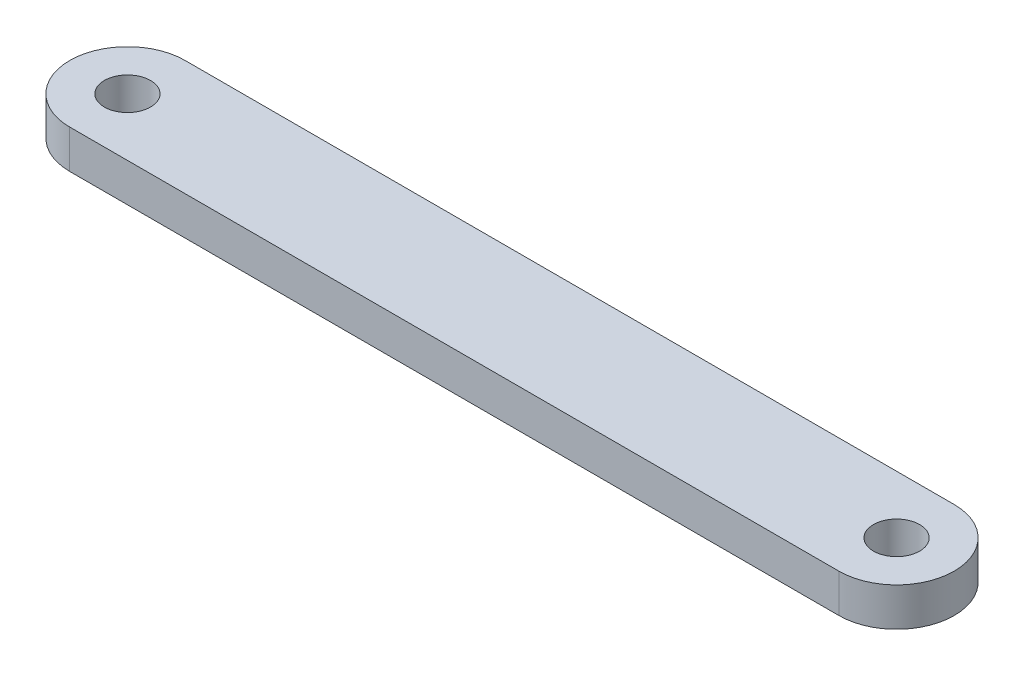
ISO-10303-21;
HEADER;
FILE_DESCRIPTION(('STEP AP214'),'2;1');
FILE_NAME('part.step','',(''),(''),'','','');
FILE_SCHEMA(('AUTOMOTIVE_DESIGN { 1 0 10303 214 1 1 1 1 }'));
ENDSEC;
DATA;
#1=APPLICATION_CONTEXT('core data for automotive mechanical design processes');
#2=APPLICATION_PROTOCOL_DEFINITION('international standard','automotive_design',2000,#1);
#3=PRODUCT_CONTEXT('',#1,'mechanical');
#4=PRODUCT('Part','Part','',(#3));
#5=PRODUCT_RELATED_PRODUCT_CATEGORY('part','',(#4));
#6=PRODUCT_DEFINITION_FORMATION('','',#4);
#7=PRODUCT_DEFINITION_CONTEXT('part definition',#1,'design');
#8=PRODUCT_DEFINITION('design','',#6,#7);
#9=PRODUCT_DEFINITION_SHAPE('','',#8);
#10=(LENGTH_UNIT() NAMED_UNIT(*) SI_UNIT(.MILLI.,.METRE.));
#11=(NAMED_UNIT(*) PLANE_ANGLE_UNIT() SI_UNIT($,.RADIAN.));
#12=(NAMED_UNIT(*) SI_UNIT($,.STERADIAN.) SOLID_ANGLE_UNIT());
#13=UNCERTAINTY_MEASURE_WITH_UNIT(LENGTH_MEASURE(1.E-05),#10,'distance_accuracy_value','');
#14=(GEOMETRIC_REPRESENTATION_CONTEXT(3) GLOBAL_UNCERTAINTY_ASSIGNED_CONTEXT((#13)) GLOBAL_UNIT_ASSIGNED_CONTEXT((#10,
#11,#12)) REPRESENTATION_CONTEXT('',''));
#15=CARTESIAN_POINT('',(0.,0.,0.));
#16=DIRECTION('',(0.,0.,1.));
#17=DIRECTION('',(1.,0.,0.));
#18=AXIS2_PLACEMENT_3D('',#15,#16,#17);
#19=CARTESIAN_POINT('',(0.,5.,0.));
#20=DIRECTION('',(0.,1.,0.));
#21=DIRECTION('',(0.,0.,1.));
#22=AXIS2_PLACEMENT_3D('',#19,#20,#21);
#23=PLANE('',#22);
#24=CARTESIAN_POINT('',(100.,5.,0.));
#25=DIRECTION('',(0.,1.,0.));
#26=DIRECTION('',(0.,0.,1.));
#27=AXIS2_PLACEMENT_3D('',#24,#25,#26);
#28=CIRCLE('',#27,3.00000000000001);
#29=CARTESIAN_POINT('',(100.,5.,3.00000000000001));
#30=VERTEX_POINT('',#29);
#31=EDGE_CURVE('E106',#30,#30,#28,.T.);
#32=ORIENTED_EDGE('',*,*,#31,.F.);
#33=EDGE_LOOP('',(#32));
#34=FACE_BOUND('',#33,.T.);
#35=CARTESIAN_POINT('',(0.,5.,0.));
#36=DIRECTION('',(0.,1.,0.));
#37=DIRECTION('',(0.,0.,1.));
#38=AXIS2_PLACEMENT_3D('',#35,#36,#37);
#39=CIRCLE('',#38,7.5);
#40=CARTESIAN_POINT('',(0.,5.,-7.5));
#41=VERTEX_POINT('',#40);
#42=CARTESIAN_POINT('',(0.,5.,7.5));
#43=VERTEX_POINT('',#42);
#44=EDGE_CURVE('E91',#41,#43,#39,.T.);
#45=ORIENTED_EDGE('',*,*,#44,.T.);
#46=DIRECTION('',(1.,0.,0.));
#47=VECTOR('',#46,1.);
#48=CARTESIAN_POINT('',(0.,5.,7.5));
#49=LINE('',#48,#47);
#50=CARTESIAN_POINT('',(100.,5.,7.5));
#51=VERTEX_POINT('',#50);
#52=EDGE_CURVE('E86',#43,#51,#49,.T.);
#53=ORIENTED_EDGE('',*,*,#52,.T.);
#54=CARTESIAN_POINT('',(100.,5.,0.));
#55=DIRECTION('',(0.,1.,0.));
#56=DIRECTION('',(0.,0.,1.));
#57=AXIS2_PLACEMENT_3D('',#54,#55,#56);
#58=CIRCLE('',#57,7.5);
#59=CARTESIAN_POINT('',(100.,5.,-7.5));
#60=VERTEX_POINT('',#59);
#61=EDGE_CURVE('E89',#51,#60,#58,.T.);
#62=ORIENTED_EDGE('',*,*,#61,.T.);
#63=DIRECTION('',(-1.,0.,0.));
#64=VECTOR('',#63,1.);
#65=CARTESIAN_POINT('',(0.,5.,-7.5));
#66=LINE('',#65,#64);
#67=EDGE_CURVE('E56',#60,#41,#66,.T.);
#68=ORIENTED_EDGE('',*,*,#67,.T.);
#69=EDGE_LOOP('',(#45,#53,#62,#68));
#70=FACE_BOUND('',#69,.T.);
#71=CARTESIAN_POINT('',(0.,5.,0.));
#72=DIRECTION('',(0.,1.,0.));
#73=DIRECTION('',(0.,0.,1.));
#74=AXIS2_PLACEMENT_3D('',#71,#72,#73);
#75=CIRCLE('',#74,3.);
#76=CARTESIAN_POINT('',(0.,5.,3.));
#77=VERTEX_POINT('',#76);
#78=EDGE_CURVE('E121',#77,#77,#75,.T.);
#79=ORIENTED_EDGE('',*,*,#78,.F.);
#80=EDGE_LOOP('',(#79));
#81=FACE_BOUND('',#80,.T.);
#82=ADVANCED_FACE('F39',(#34,#70,#81),#23,.T.);
#83=CARTESIAN_POINT('',(0.,0.,0.));
#84=DIRECTION('',(0.,1.,0.));
#85=DIRECTION('',(0.,0.,1.));
#86=AXIS2_PLACEMENT_3D('',#83,#84,#85);
#87=PLANE('',#86);
#88=CARTESIAN_POINT('',(0.,0.,0.));
#89=DIRECTION('',(0.,1.,0.));
#90=DIRECTION('',(0.,0.,1.));
#91=AXIS2_PLACEMENT_3D('',#88,#89,#90);
#92=CIRCLE('',#91,7.5);
#93=CARTESIAN_POINT('',(0.,0.,-7.5));
#94=VERTEX_POINT('',#93);
#95=CARTESIAN_POINT('',(0.,0.,7.5));
#96=VERTEX_POINT('',#95);
#97=EDGE_CURVE('E103',#94,#96,#92,.T.);
#98=ORIENTED_EDGE('',*,*,#97,.F.);
#99=DIRECTION('',(-1.,0.,0.));
#100=VECTOR('',#99,1.);
#101=CARTESIAN_POINT('',(0.,0.,-7.5));
#102=LINE('',#101,#100);
#103=CARTESIAN_POINT('',(100.,0.,-7.5));
#104=VERTEX_POINT('',#103);
#105=EDGE_CURVE('E79',#104,#94,#102,.T.);
#106=ORIENTED_EDGE('',*,*,#105,.F.);
#107=CARTESIAN_POINT('',(100.,0.,0.));
#108=DIRECTION('',(0.,1.,0.));
#109=DIRECTION('',(0.,0.,1.));
#110=AXIS2_PLACEMENT_3D('',#107,#108,#109);
#111=CIRCLE('',#110,7.5);
#112=CARTESIAN_POINT('',(100.,0.,7.5));
#113=VERTEX_POINT('',#112);
#114=EDGE_CURVE('E73',#113,#104,#111,.T.);
#115=ORIENTED_EDGE('',*,*,#114,.F.);
#116=DIRECTION('',(1.,0.,0.));
#117=VECTOR('',#116,1.);
#118=CARTESIAN_POINT('',(0.,0.,7.5));
#119=LINE('',#118,#117);
#120=EDGE_CURVE('E95',#96,#113,#119,.T.);
#121=ORIENTED_EDGE('',*,*,#120,.F.);
#122=EDGE_LOOP('',(#98,#106,#115,#121));
#123=FACE_BOUND('',#122,.T.);
#124=CARTESIAN_POINT('',(100.,0.,0.));
#125=DIRECTION('',(0.,1.,0.));
#126=DIRECTION('',(0.,0.,1.));
#127=AXIS2_PLACEMENT_3D('',#124,#125,#126);
#128=CIRCLE('',#127,3.00000000000001);
#129=CARTESIAN_POINT('',(100.,0.,3.00000000000001));
#130=VERTEX_POINT('',#129);
#131=EDGE_CURVE('E118',#130,#130,#128,.T.);
#132=ORIENTED_EDGE('',*,*,#131,.T.);
#133=EDGE_LOOP('',(#132));
#134=FACE_BOUND('',#133,.T.);
#135=CARTESIAN_POINT('',(0.,0.,0.));
#136=DIRECTION('',(0.,1.,0.));
#137=DIRECTION('',(0.,0.,1.));
#138=AXIS2_PLACEMENT_3D('',#135,#136,#137);
#139=CIRCLE('',#138,3.);
#140=CARTESIAN_POINT('',(0.,0.,3.));
#141=VERTEX_POINT('',#140);
#142=EDGE_CURVE('E124',#141,#141,#139,.T.);
#143=ORIENTED_EDGE('',*,*,#142,.T.);
#144=EDGE_LOOP('',(#143));
#145=FACE_BOUND('',#144,.T.);
#146=ADVANCED_FACE('F114',(#123,#134,#145),#87,.F.);
#147=CARTESIAN_POINT('',(0.,5.,0.));
#148=DIRECTION('',(0.,-1.,0.));
#149=DIRECTION('',(0.,0.,-1.));
#150=AXIS2_PLACEMENT_3D('',#147,#148,#149);
#151=CYLINDRICAL_SURFACE('',#150,7.5);
#152=ORIENTED_EDGE('',*,*,#97,.T.);
#153=DIRECTION('',(0.,-1.,0.));
#154=VECTOR('',#153,1.);
#155=CARTESIAN_POINT('',(0.,5.,7.5));
#156=LINE('',#155,#154);
#157=EDGE_CURVE('E11',#43,#96,#156,.T.);
#158=ORIENTED_EDGE('',*,*,#157,.F.);
#159=ORIENTED_EDGE('',*,*,#44,.F.);
#160=DIRECTION('',(0.,-1.,0.));
#161=VECTOR('',#160,1.);
#162=CARTESIAN_POINT('',(0.,5.,-7.5));
#163=LINE('',#162,#161);
#164=EDGE_CURVE('E99',#41,#94,#163,.T.);
#165=ORIENTED_EDGE('',*,*,#164,.T.);
#166=EDGE_LOOP('',(#152,#158,#159,#165));
#167=FACE_BOUND('',#166,.T.);
#168=ADVANCED_FACE('F41',(#167),#151,.T.);
#169=CARTESIAN_POINT('',(0.,5.,7.5));
#170=DIRECTION('',(0.,0.,-1.));
#171=DIRECTION('',(-1.,0.,0.));
#172=AXIS2_PLACEMENT_3D('',#169,#170,#171);
#173=PLANE('',#172);
#174=ORIENTED_EDGE('',*,*,#120,.T.);
#175=DIRECTION('',(0.,-1.,0.));
#176=VECTOR('',#175,1.);
#177=CARTESIAN_POINT('',(100.,5.,7.5));
#178=LINE('',#177,#176);
#179=EDGE_CURVE('E48',#51,#113,#178,.T.);
#180=ORIENTED_EDGE('',*,*,#179,.F.);
#181=ORIENTED_EDGE('',*,*,#52,.F.);
#182=ORIENTED_EDGE('',*,*,#157,.T.);
#183=EDGE_LOOP('',(#174,#180,#181,#182));
#184=FACE_BOUND('',#183,.T.);
#185=ADVANCED_FACE('F94',(#184),#173,.F.);
#186=CARTESIAN_POINT('',(100.,5.,0.));
#187=DIRECTION('',(0.,-1.,0.));
#188=DIRECTION('',(0.,0.,-1.));
#189=AXIS2_PLACEMENT_3D('',#186,#187,#188);
#190=CYLINDRICAL_SURFACE('',#189,7.5);
#191=ORIENTED_EDGE('',*,*,#114,.T.);
#192=DIRECTION('',(0.,-1.,0.));
#193=VECTOR('',#192,1.);
#194=CARTESIAN_POINT('',(100.,5.,-7.5));
#195=LINE('',#194,#193);
#196=EDGE_CURVE('E96',#60,#104,#195,.T.);
#197=ORIENTED_EDGE('',*,*,#196,.F.);
#198=ORIENTED_EDGE('',*,*,#61,.F.);
#199=ORIENTED_EDGE('',*,*,#179,.T.);
#200=EDGE_LOOP('',(#191,#197,#198,#199));
#201=FACE_BOUND('',#200,.T.);
#202=ADVANCED_FACE('F97',(#201),#190,.T.);
#203=CARTESIAN_POINT('',(0.,5.,-7.5));
#204=DIRECTION('',(0.,0.,1.));
#205=DIRECTION('',(1.,0.,0.));
#206=AXIS2_PLACEMENT_3D('',#203,#204,#205);
#207=PLANE('',#206);
#208=ORIENTED_EDGE('',*,*,#105,.T.);
#209=ORIENTED_EDGE('',*,*,#164,.F.);
#210=ORIENTED_EDGE('',*,*,#67,.F.);
#211=ORIENTED_EDGE('',*,*,#196,.T.);
#212=EDGE_LOOP('',(#208,#209,#210,#211));
#213=FACE_BOUND('',#212,.T.);
#214=ADVANCED_FACE('F111',(#213),#207,.F.);
#215=CARTESIAN_POINT('',(100.,5.,0.));
#216=DIRECTION('',(0.,-1.,0.));
#217=DIRECTION('',(0.,0.,-1.));
#218=AXIS2_PLACEMENT_3D('',#215,#216,#217);
#219=CYLINDRICAL_SURFACE('',#218,3.00000000000001);
#220=ORIENTED_EDGE('',*,*,#31,.T.);
#221=EDGE_LOOP('',(#220));
#222=FACE_BOUND('',#221,.T.);
#223=ORIENTED_EDGE('',*,*,#131,.F.);
#224=EDGE_LOOP('',(#223));
#225=FACE_BOUND('',#224,.T.);
#226=ADVANCED_FACE('F141',(#222,#225),#219,.F.);
#227=CARTESIAN_POINT('',(0.,5.,0.));
#228=DIRECTION('',(0.,-1.,0.));
#229=DIRECTION('',(0.,0.,-1.));
#230=AXIS2_PLACEMENT_3D('',#227,#228,#229);
#231=CYLINDRICAL_SURFACE('',#230,3.);
#232=ORIENTED_EDGE('',*,*,#78,.T.);
#233=EDGE_LOOP('',(#232));
#234=FACE_BOUND('',#233,.T.);
#235=ORIENTED_EDGE('',*,*,#142,.F.);
#236=EDGE_LOOP('',(#235));
#237=FACE_BOUND('',#236,.T.);
#238=ADVANCED_FACE('F130',(#234,#237),#231,.F.);
#239=CLOSED_SHELL('',(#82,#146,#168,#185,#202,#214,#226,#238));
#240=MANIFOLD_SOLID_BREP('B2',#239);
#241=ADVANCED_BREP_SHAPE_REPRESENTATION('',(#18,#240),#14);
#242=SHAPE_DEFINITION_REPRESENTATION(#9,#241);
ENDSEC;
END-ISO-10303-21;
